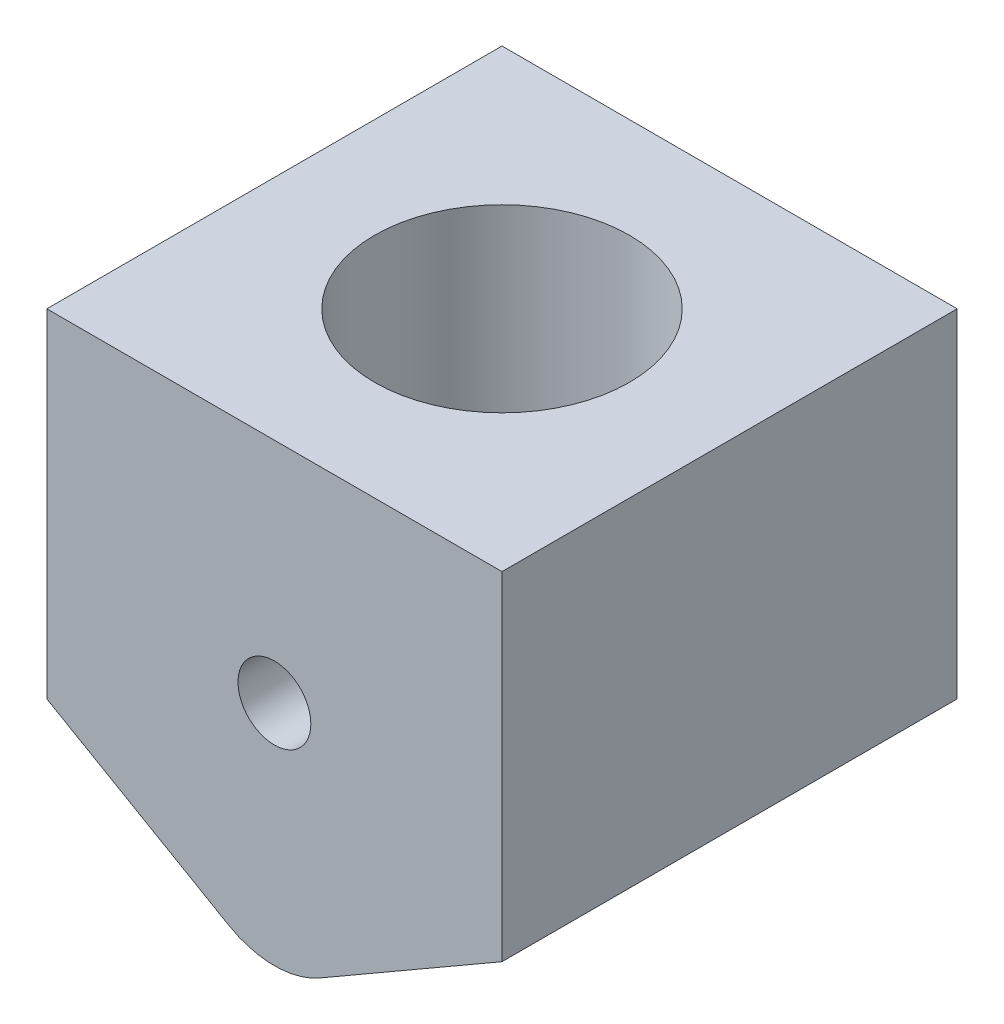
ISO-10303-21;
HEADER;
FILE_DESCRIPTION(('STEP AP214'),'2;1');
FILE_NAME('part.step','',(''),(''),'','','');
FILE_SCHEMA(('AUTOMOTIVE_DESIGN { 1 0 10303 214 1 1 1 1 }'));
ENDSEC;
DATA;
#1=APPLICATION_CONTEXT('core data for automotive mechanical design processes');
#2=APPLICATION_PROTOCOL_DEFINITION('international standard','automotive_design',2000,#1);
#3=PRODUCT_CONTEXT('',#1,'mechanical');
#4=PRODUCT('Part','Part','',(#3));
#5=PRODUCT_RELATED_PRODUCT_CATEGORY('part','',(#4));
#6=PRODUCT_DEFINITION_FORMATION('','',#4);
#7=PRODUCT_DEFINITION_CONTEXT('part definition',#1,'design');
#8=PRODUCT_DEFINITION('design','',#6,#7);
#9=PRODUCT_DEFINITION_SHAPE('','',#8);
#10=(LENGTH_UNIT() NAMED_UNIT(*) SI_UNIT(.MILLI.,.METRE.));
#11=(NAMED_UNIT(*) PLANE_ANGLE_UNIT() SI_UNIT($,.RADIAN.));
#12=(NAMED_UNIT(*) SI_UNIT($,.STERADIAN.) SOLID_ANGLE_UNIT());
#13=UNCERTAINTY_MEASURE_WITH_UNIT(LENGTH_MEASURE(1.E-05),#10,'distance_accuracy_value','');
#14=(GEOMETRIC_REPRESENTATION_CONTEXT(3) GLOBAL_UNCERTAINTY_ASSIGNED_CONTEXT((#13)) GLOBAL_UNIT_ASSIGNED_CONTEXT((#10,
#11,#12)) REPRESENTATION_CONTEXT('',''));
#15=CARTESIAN_POINT('',(0.,0.,0.));
#16=DIRECTION('',(0.,0.,1.));
#17=DIRECTION('',(1.,0.,0.));
#18=AXIS2_PLACEMENT_3D('',#15,#16,#17);
#19=CARTESIAN_POINT('',(25.,0.,25.));
#20=DIRECTION('',(-1.,0.,0.));
#21=DIRECTION('',(0.,0.,1.));
#22=AXIS2_PLACEMENT_3D('',#19,#20,#21);
#23=PLANE('',#22);
#24=DIRECTION('',(0.,1.,0.));
#25=VECTOR('',#24,1.);
#26=CARTESIAN_POINT('',(25.,0.,-25.));
#27=LINE('',#26,#25);
#28=CARTESIAN_POINT('',(25.,-37.1132486540518,-25.));
#29=VERTEX_POINT('',#28);
#30=CARTESIAN_POINT('',(25.,0.,-25.));
#31=VERTEX_POINT('',#30);
#32=EDGE_CURVE('E126',#29,#31,#27,.T.);
#33=ORIENTED_EDGE('',*,*,#32,.T.);
#34=DIRECTION('',(0.,0.,-1.));
#35=VECTOR('',#34,1.);
#36=CARTESIAN_POINT('',(25.,0.,25.));
#37=LINE('',#36,#35);
#38=CARTESIAN_POINT('',(25.,0.,25.));
#39=VERTEX_POINT('',#38);
#40=EDGE_CURVE('E11',#39,#31,#37,.T.);
#41=ORIENTED_EDGE('',*,*,#40,.F.);
#42=DIRECTION('',(0.,1.,0.));
#43=VECTOR('',#42,1.);
#44=CARTESIAN_POINT('',(25.,0.,25.));
#45=LINE('',#44,#43);
#46=CARTESIAN_POINT('',(25.,-37.1132486540518,25.));
#47=VERTEX_POINT('',#46);
#48=EDGE_CURVE('E138',#47,#39,#45,.T.);
#49=ORIENTED_EDGE('',*,*,#48,.F.);
#50=DIRECTION('',(0.,0.,-1.));
#51=VECTOR('',#50,1.);
#52=CARTESIAN_POINT('',(25.,-37.1132486540518,25.));
#53=LINE('',#52,#51);
#54=EDGE_CURVE('E122',#47,#29,#53,.T.);
#55=ORIENTED_EDGE('',*,*,#54,.T.);
#56=EDGE_LOOP('',(#33,#41,#49,#55));
#57=FACE_BOUND('',#56,.T.);
#58=ADVANCED_FACE('F37',(#57),#23,.F.);
#59=CARTESIAN_POINT('',(-25.,0.,25.));
#60=DIRECTION('',(0.,-1.,0.));
#61=DIRECTION('',(0.,0.,-1.));
#62=AXIS2_PLACEMENT_3D('',#59,#60,#61);
#63=PLANE('',#62);
#64=CARTESIAN_POINT('',(0.,0.,0.));
#65=DIRECTION('',(0.,1.,0.));
#66=DIRECTION('',(0.,0.,1.));
#67=AXIS2_PLACEMENT_3D('',#64,#65,#66);
#68=CIRCLE('',#67,14.);
#69=CARTESIAN_POINT('',(0.,0.,14.));
#70=VERTEX_POINT('',#69);
#71=EDGE_CURVE('E155',#70,#70,#68,.T.);
#72=ORIENTED_EDGE('',*,*,#71,.F.);
#73=EDGE_LOOP('',(#72));
#74=FACE_BOUND('',#73,.T.);
#75=DIRECTION('',(-1.,0.,0.));
#76=VECTOR('',#75,1.);
#77=CARTESIAN_POINT('',(-25.,0.,-25.));
#78=LINE('',#77,#76);
#79=CARTESIAN_POINT('',(-25.,0.,-25.));
#80=VERTEX_POINT('',#79);
#81=EDGE_CURVE('E129',#31,#80,#78,.T.);
#82=ORIENTED_EDGE('',*,*,#81,.T.);
#83=DIRECTION('',(0.,0.,-1.));
#84=VECTOR('',#83,1.);
#85=CARTESIAN_POINT('',(-25.,0.,25.));
#86=LINE('',#85,#84);
#87=CARTESIAN_POINT('',(-25.,0.,25.));
#88=VERTEX_POINT('',#87);
#89=EDGE_CURVE('E44',#88,#80,#86,.T.);
#90=ORIENTED_EDGE('',*,*,#89,.F.);
#91=DIRECTION('',(-1.,0.,0.));
#92=VECTOR('',#91,1.);
#93=CARTESIAN_POINT('',(-25.,0.,25.));
#94=LINE('',#93,#92);
#95=EDGE_CURVE('E91',#39,#88,#94,.T.);
#96=ORIENTED_EDGE('',*,*,#95,.F.);
#97=ORIENTED_EDGE('',*,*,#40,.T.);
#98=EDGE_LOOP('',(#82,#90,#96,#97));
#99=FACE_BOUND('',#98,.T.);
#100=ADVANCED_FACE('F193',(#74,#99),#63,.F.);
#101=CARTESIAN_POINT('',(-25.,0.,25.));
#102=DIRECTION('',(1.,0.,0.));
#103=DIRECTION('',(0.,0.,-1.));
#104=AXIS2_PLACEMENT_3D('',#101,#102,#103);
#105=PLANE('',#104);
#106=DIRECTION('',(0.,-1.,0.));
#107=VECTOR('',#106,1.);
#108=CARTESIAN_POINT('',(-25.,0.,-25.));
#109=LINE('',#108,#107);
#110=CARTESIAN_POINT('',(-25.,-37.1132486540519,-25.));
#111=VERTEX_POINT('',#110);
#112=EDGE_CURVE('E132',#80,#111,#109,.T.);
#113=ORIENTED_EDGE('',*,*,#112,.T.);
#114=DIRECTION('',(0.,0.,-1.));
#115=VECTOR('',#114,1.);
#116=CARTESIAN_POINT('',(-25.,-37.1132486540519,25.));
#117=LINE('',#116,#115);
#118=CARTESIAN_POINT('',(-25.,-37.1132486540519,25.));
#119=VERTEX_POINT('',#118);
#120=EDGE_CURVE('E117',#119,#111,#117,.T.);
#121=ORIENTED_EDGE('',*,*,#120,.F.);
#122=DIRECTION('',(0.,-1.,0.));
#123=VECTOR('',#122,1.);
#124=CARTESIAN_POINT('',(-25.,0.,25.));
#125=LINE('',#124,#123);
#126=EDGE_CURVE('E105',#88,#119,#125,.T.);
#127=ORIENTED_EDGE('',*,*,#126,.F.);
#128=ORIENTED_EDGE('',*,*,#89,.T.);
#129=EDGE_LOOP('',(#113,#121,#127,#128));
#130=FACE_BOUND('',#129,.T.);
#131=ADVANCED_FACE('F144',(#130),#105,.F.);
#132=CARTESIAN_POINT('',(-25.,-37.1132486540519,25.));
#133=DIRECTION('',(0.499999999999999,0.866025403784439,0.));
#134=DIRECTION('',(-0.866025403784439,0.499999999999999,0.));
#135=AXIS2_PLACEMENT_3D('',#132,#133,#134);
#136=PLANE('',#135);
#137=DIRECTION('',(0.866025403784439,-0.499999999999999,0.));
#138=VECTOR('',#137,1.);
#139=CARTESIAN_POINT('',(-25.,-37.1132486540519,-25.));
#140=LINE('',#139,#138);
#141=CARTESIAN_POINT('',(-4.99999999999999,-48.6602540378444,-25.));
#142=VERTEX_POINT('',#141);
#143=EDGE_CURVE('E114',#111,#142,#140,.T.);
#144=ORIENTED_EDGE('',*,*,#143,.T.);
#145=DIRECTION('',(0.,0.,-1.));
#146=VECTOR('',#145,1.);
#147=CARTESIAN_POINT('',(-4.99999999999999,-48.6602540378444,25.));
#148=LINE('',#147,#146);
#149=CARTESIAN_POINT('',(-4.99999999999999,-48.6602540378444,25.));
#150=VERTEX_POINT('',#149);
#151=EDGE_CURVE('E111',#150,#142,#148,.T.);
#152=ORIENTED_EDGE('',*,*,#151,.F.);
#153=DIRECTION('',(0.866025403784439,-0.499999999999999,0.));
#154=VECTOR('',#153,1.);
#155=CARTESIAN_POINT('',(-25.,-37.1132486540519,25.));
#156=LINE('',#155,#154);
#157=EDGE_CURVE('E98',#119,#150,#156,.T.);
#158=ORIENTED_EDGE('',*,*,#157,.F.);
#159=ORIENTED_EDGE('',*,*,#120,.T.);
#160=EDGE_LOOP('',(#144,#152,#158,#159));
#161=FACE_BOUND('',#160,.T.);
#162=ADVANCED_FACE('F112',(#161),#136,.F.);
#163=CARTESIAN_POINT('',(1.87783816274489E-13,-40.,25.));
#164=DIRECTION('',(0.,0.,-1.));
#165=DIRECTION('',(-1.,0.,0.));
#166=AXIS2_PLACEMENT_3D('',#163,#164,#165);
#167=CYLINDRICAL_SURFACE('',#166,10.);
#168=CARTESIAN_POINT('',(1.87783816274489E-13,-40.,-25.));
#169=DIRECTION('',(0.,0.,1.));
#170=DIRECTION('',(-1.,0.,0.));
#171=AXIS2_PLACEMENT_3D('',#168,#169,#170);
#172=CIRCLE('',#171,10.);
#173=CARTESIAN_POINT('',(5.00000000000005,-48.6602540378445,-25.));
#174=VERTEX_POINT('',#173);
#175=EDGE_CURVE('E135',#142,#174,#172,.T.);
#176=ORIENTED_EDGE('',*,*,#175,.T.);
#177=DIRECTION('',(0.,0.,-1.));
#178=VECTOR('',#177,1.);
#179=CARTESIAN_POINT('',(5.00000000000005,-48.6602540378445,25.));
#180=LINE('',#179,#178);
#181=CARTESIAN_POINT('',(5.00000000000005,-48.6602540378445,25.));
#182=VERTEX_POINT('',#181);
#183=EDGE_CURVE('E118',#182,#174,#180,.T.);
#184=ORIENTED_EDGE('',*,*,#183,.F.);
#185=CARTESIAN_POINT('',(1.87783816274489E-13,-40.,25.));
#186=DIRECTION('',(0.,0.,1.));
#187=DIRECTION('',(-1.,0.,0.));
#188=AXIS2_PLACEMENT_3D('',#185,#186,#187);
#189=CIRCLE('',#188,10.);
#190=EDGE_CURVE('E102',#150,#182,#189,.T.);
#191=ORIENTED_EDGE('',*,*,#190,.F.);
#192=ORIENTED_EDGE('',*,*,#151,.T.);
#193=EDGE_LOOP('',(#176,#184,#191,#192));
#194=FACE_BOUND('',#193,.T.);
#195=ADVANCED_FACE('F120',(#194),#167,.T.);
#196=CARTESIAN_POINT('',(25.,-37.1132486540518,25.));
#197=DIRECTION('',(-0.500000000000001,0.866025403784438,0.));
#198=DIRECTION('',(-0.866025403784438,-0.500000000000001,0.));
#199=AXIS2_PLACEMENT_3D('',#196,#197,#198);
#200=PLANE('',#199);
#201=DIRECTION('',(0.866025403784438,0.500000000000001,0.));
#202=VECTOR('',#201,1.);
#203=CARTESIAN_POINT('',(25.,-37.1132486540518,-25.));
#204=LINE('',#203,#202);
#205=EDGE_CURVE('E83',#174,#29,#204,.T.);
#206=ORIENTED_EDGE('',*,*,#205,.T.);
#207=ORIENTED_EDGE('',*,*,#54,.F.);
#208=DIRECTION('',(0.866025403784438,0.500000000000001,0.));
#209=VECTOR('',#208,1.);
#210=CARTESIAN_POINT('',(25.,-37.1132486540518,25.));
#211=LINE('',#210,#209);
#212=EDGE_CURVE('E57',#182,#47,#211,.T.);
#213=ORIENTED_EDGE('',*,*,#212,.F.);
#214=ORIENTED_EDGE('',*,*,#183,.T.);
#215=EDGE_LOOP('',(#206,#207,#213,#214));
#216=FACE_BOUND('',#215,.T.);
#217=ADVANCED_FACE('F148',(#216),#200,.F.);
#218=CARTESIAN_POINT('',(1.87783816274489E-13,-40.,25.));
#219=DIRECTION('',(0.,0.,-1.));
#220=DIRECTION('',(-1.,0.,0.));
#221=AXIS2_PLACEMENT_3D('',#218,#219,#220);
#222=PLANE('',#221);
#223=CARTESIAN_POINT('',(0.,-25.,25.));
#224=DIRECTION('',(0.,0.,1.));
#225=DIRECTION('',(1.,0.,0.));
#226=AXIS2_PLACEMENT_3D('',#223,#224,#225);
#227=CIRCLE('',#226,4.);
#228=CARTESIAN_POINT('',(4.,-25.,25.));
#229=VERTEX_POINT('',#228);
#230=EDGE_CURVE('E166',#229,#229,#227,.T.);
#231=ORIENTED_EDGE('',*,*,#230,.F.);
#232=EDGE_LOOP('',(#231));
#233=FACE_BOUND('',#232,.T.);
#234=ORIENTED_EDGE('',*,*,#48,.T.);
#235=ORIENTED_EDGE('',*,*,#95,.T.);
#236=ORIENTED_EDGE('',*,*,#126,.T.);
#237=ORIENTED_EDGE('',*,*,#157,.T.);
#238=ORIENTED_EDGE('',*,*,#190,.T.);
#239=ORIENTED_EDGE('',*,*,#212,.T.);
#240=EDGE_LOOP('',(#234,#235,#236,#237,#238,#239));
#241=FACE_BOUND('',#240,.T.);
#242=ADVANCED_FACE('F100',(#233,#241),#222,.F.);
#243=CARTESIAN_POINT('',(1.87783816274489E-13,-40.,-25.));
#244=DIRECTION('',(0.,0.,-1.));
#245=DIRECTION('',(-1.,0.,0.));
#246=AXIS2_PLACEMENT_3D('',#243,#244,#245);
#247=PLANE('',#246);
#248=ORIENTED_EDGE('',*,*,#32,.F.);
#249=ORIENTED_EDGE('',*,*,#205,.F.);
#250=ORIENTED_EDGE('',*,*,#175,.F.);
#251=ORIENTED_EDGE('',*,*,#143,.F.);
#252=ORIENTED_EDGE('',*,*,#112,.F.);
#253=ORIENTED_EDGE('',*,*,#81,.F.);
#254=EDGE_LOOP('',(#248,#249,#250,#251,#252,#253));
#255=FACE_BOUND('',#254,.T.);
#256=ADVANCED_FACE('F147',(#255),#247,.T.);
#257=CARTESIAN_POINT('',(0.,-29.,0.));
#258=DIRECTION('',(0.,1.,0.));
#259=DIRECTION('',(0.,0.,1.));
#260=AXIS2_PLACEMENT_3D('',#257,#258,#259);
#261=CYLINDRICAL_SURFACE('',#260,14.);
#262=CARTESIAN_POINT('',(0.,-29.,0.));
#263=DIRECTION('',(0.,1.,0.));
#264=DIRECTION('',(0.,0.,1.));
#265=AXIS2_PLACEMENT_3D('',#262,#263,#264);
#266=CIRCLE('',#265,14.);
#267=CARTESIAN_POINT('',(0.,-29.,14.));
#268=VERTEX_POINT('',#267);
#269=EDGE_CURVE('E130',#268,#268,#266,.T.);
#270=ORIENTED_EDGE('',*,*,#269,.F.);
#271=CARTESIAN_POINT('',(0.,-29.,14.));
#272=CARTESIAN_POINT('',(-0.219909804754502,-28.9999961208761,13.9999973858868));
#273=CARTESIAN_POINT('',(-0.439859495745163,-28.9818044220478,13.9947683480409));
#274=CARTESIAN_POINT('',(-0.873383982393978,-28.9096714597954,13.9744181189021));
#275=CARTESIAN_POINT('',(-1.08695633365923,-28.8557166678518,13.9592931842017));
#276=CARTESIAN_POINT('',(-1.50140860147574,-28.713983923167,13.9208138269815));
#277=CARTESIAN_POINT('',(-1.70230576169645,-28.6262531276961,13.8974708821268));
#278=CARTESIAN_POINT('',(-2.08653752225854,-28.4196440170433,13.8449995663309));
#279=CARTESIAN_POINT('',(-2.26987028235633,-28.3007624430193,13.8158705901604));
#280=CARTESIAN_POINT('',(-2.61858889371789,-28.0319299786542,13.7540946925116));
#281=CARTESIAN_POINT('',(-2.78344744476188,-27.8813104922895,13.7213808389038));
#282=CARTESIAN_POINT('',(-3.0859427158487,-27.5547045137246,13.6565346983128));
#283=CARTESIAN_POINT('',(-3.22357535415565,-27.3787142247355,13.6244024991869));
#284=CARTESIAN_POINT('',(-3.4703958001286,-27.0020128344182,13.5636602975078));
#285=CARTESIAN_POINT('',(-3.57895642206696,-26.8008760298703,13.5351340501204));
#286=CARTESIAN_POINT('',(-3.76050341107961,-26.3822559764985,13.4858268768133));
#287=CARTESIAN_POINT('',(-3.83349743111438,-26.1647762558582,13.4650442848974));
#288=CARTESIAN_POINT('',(-3.9399686602775,-25.7255304736689,13.4342721639203));
#289=CARTESIAN_POINT('',(-3.97441106405699,-25.5040172744643,13.4240195714002));
#290=CARTESIAN_POINT('',(-4.00581335578369,-25.0581377031078,13.4146841640399));
#291=CARTESIAN_POINT('',(-4.00278138819242,-24.8337719614996,13.4155989221522));
#292=CARTESIAN_POINT('',(-3.96008269525806,-24.3962627770877,13.4282606881987));
#293=CARTESIAN_POINT('',(-3.92160651456782,-24.1829912976385,13.4396556539587));
#294=CARTESIAN_POINT('',(-3.81102772171578,-23.7660655607448,13.4714269676562));
#295=CARTESIAN_POINT('',(-3.73892206962499,-23.562412174559,13.4918041275281));
#296=CARTESIAN_POINT('',(-3.56221362275624,-23.1675075111364,13.5395372703216));
#297=CARTESIAN_POINT('',(-3.45721102345763,-22.9764458551967,13.566978328113));
#298=CARTESIAN_POINT('',(-3.21796758335769,-22.6142468775732,13.6257043376412));
#299=CARTESIAN_POINT('',(-3.08372023346689,-22.4431140045302,13.6569901444382));
#300=CARTESIAN_POINT('',(-2.78380799346042,-22.1188552487873,13.7213250131271));
#301=CARTESIAN_POINT('',(-2.61714974969065,-21.9666510480655,13.7543960914473));
#302=CARTESIAN_POINT('',(-2.26026456477245,-21.6921479927194,13.8175249443669));
#303=CARTESIAN_POINT('',(-2.07003640296378,-21.5698506879166,13.8475825627565));
#304=CARTESIAN_POINT('',(-1.66984614618289,-21.3581425304519,13.90153056131));
#305=CARTESIAN_POINT('',(-1.45977963562001,-21.2689194263916,13.9253855099446));
#306=CARTESIAN_POINT('',(-1.02678645993494,-21.1273322171664,13.9639850297517));
#307=CARTESIAN_POINT('',(-0.803863051620289,-21.0749588215095,13.9787318971251));
#308=CARTESIAN_POINT('',(-0.359332777288698,-21.0100534285811,13.9970974902934));
#309=CARTESIAN_POINT('',(-0.137922693721014,-20.9962706092539,14.001065457012));
#310=CARTESIAN_POINT('',(0.304053053611167,-21.0054545326021,13.9984416941418));
#311=CARTESIAN_POINT('',(0.524618815514217,-21.0284168656918,13.9918512316126));
#312=CARTESIAN_POINT('',(0.95403726686063,-21.1094208886325,13.9690785337041));
#313=CARTESIAN_POINT('',(1.16303642346969,-21.1667463626468,13.9530922603535));
#314=CARTESIAN_POINT('',(1.56841737241128,-21.3140010039693,13.9133599748377));
#315=CARTESIAN_POINT('',(1.76479770249744,-21.4039339417787,13.8896130653177));
#316=CARTESIAN_POINT('',(2.14408337024006,-21.6160466732903,13.8361992233827));
#317=CARTESIAN_POINT('',(2.32660497308018,-21.7388823976507,13.806415263566));
#318=CARTESIAN_POINT('',(2.66887705611895,-22.0125050119022,13.7443589419696));
#319=CARTESIAN_POINT('',(2.82862234168611,-22.1632982601291,13.7120860151051));
#320=CARTESIAN_POINT('',(3.12621285668013,-22.4944186840989,13.6473723925859));
#321=CARTESIAN_POINT('',(3.2631708548142,-22.6755505511183,13.6149607371547));
#322=CARTESIAN_POINT('',(3.5047906321352,-23.0589251772491,13.5547778947072));
#323=CARTESIAN_POINT('',(3.60945353497364,-23.2611672015417,13.5270065462548));
#324=CARTESIAN_POINT('',(3.78274908236532,-23.6801824219512,13.4795730248143));
#325=CARTESIAN_POINT('',(3.85157266479217,-23.8968715269982,13.4598680004307));
#326=CARTESIAN_POINT('',(3.9515890013583,-24.3394198711467,13.4308491335485));
#327=CARTESIAN_POINT('',(3.98279315803512,-24.5652763101419,13.4215321424767));
#328=CARTESIAN_POINT('',(4.00596048493462,-25.0105920659006,13.414634061985));
#329=CARTESIAN_POINT('',(3.99936055287513,-25.229971009185,13.4166232140829));
#330=CARTESIAN_POINT('',(3.95049421913723,-25.6643494613865,13.43109194205));
#331=CARTESIAN_POINT('',(3.9082290075969,-25.8793491161938,13.4435711678689));
#332=CARTESIAN_POINT('',(3.79011937633831,-26.2967567423123,13.4773395437571));
#333=CARTESIAN_POINT('',(3.71462183572859,-26.4992707740157,13.4985375411261));
#334=CARTESIAN_POINT('',(3.53245898603034,-26.8889174689911,13.5473460566956));
#335=CARTESIAN_POINT('',(3.42578816086269,-27.0760474025483,13.5749577096079));
#336=CARTESIAN_POINT('',(3.18013093069693,-27.4363670436088,13.6346333790399));
#337=CARTESIAN_POINT('',(3.04018455445474,-27.6088827826834,13.6668152635923));
#338=CARTESIAN_POINT('',(2.73371968075859,-27.9284477916201,13.7313969018336));
#339=CARTESIAN_POINT('',(2.56719450145708,-28.0754906382217,13.7637967083404));
#340=CARTESIAN_POINT('',(2.20714864173081,-28.3436743686531,13.8261591914504));
#341=CARTESIAN_POINT('',(2.01304500471956,-28.4640539745392,13.8560380207491));
#342=CARTESIAN_POINT('',(1.60650105929331,-28.6702915700441,13.9090279155586));
#343=CARTESIAN_POINT('',(1.39407084822947,-28.7561684238661,13.9321426774055));
#344=CARTESIAN_POINT('',(0.985832630670068,-28.8816951027909,13.9665468945063));
#345=CARTESIAN_POINT('',(0.791526015248779,-28.9259470733691,13.9789936872416));
#346=CARTESIAN_POINT('',(0.398156737572732,-28.9850993144843,13.9957208770429));
#347=CARTESIAN_POINT('',(0.199094715232183,-29.0000035119538,14.0000023666799));
#348=CARTESIAN_POINT('',(0.,-29.,14.));
#349=B_SPLINE_CURVE_WITH_KNOTS('',3,(#271,#272,#273,#274,#275,#276,#277,#278,#279,#280,#281,
#282,#283,#284,#285,#286,#287,#288,#289,#290,#291,#292,#293,#294,#295,#296,#297,#298,#299,#300,
#301,#302,#303,#304,#305,#306,#307,#308,#309,#310,#311,#312,#313,#314,#315,#316,#317,#318,#319,
#320,#321,#322,#323,#324,#325,#326,#327,#328,#329,#330,#331,#332,#333,#334,#335,#336,#337,#338,
#339,#340,#341,#342,#343,#344,#345,#346,#347,#348),.UNSPECIFIED.,.T.,.F.,(4,2,2,2,2,2,2,2,2,2,2,
2,2,2,2,2,2,2,2,2,2,2,2,2,2,2,2,2,2,2,2,2,2,2,2,2,2,2,4),(0.,0.658998625084688,1.31824667959036,
1.97657762579069,2.63497747087032,3.30895623061562,3.98303595747427,4.67066150600114,
5.35813903089619,6.02799019725499,6.69769578462466,7.34569571658666,7.99375423572252,
8.6500160658242,9.30642411154686,9.98757001205003,10.668751203109,11.353742022089,
12.0385600802922,12.700909153964,13.363178748693,14.0121028095904,14.6611019315106,
15.324150506889,15.9873500637558,16.6722420976867,17.357110299306,18.0382914673228,
18.7192661157547,19.374533632379,20.0297792838166,20.6783419259223,21.3270194000485,
21.9973531379043,22.6678556622664,23.3555595795003,24.0428869847787,24.6395893608559,
25.2362118886514),.UNSPECIFIED.);
#350=EDGE_CURVE('E49',#268,#268,#349,.T.);
#351=ORIENTED_EDGE('',*,*,#350,.F.);
#352=EDGE_LOOP('',(#270,#351));
#353=FACE_BOUND('',#352,.T.);
#354=ORIENTED_EDGE('',*,*,#71,.T.);
#355=EDGE_LOOP('',(#354));
#356=FACE_BOUND('',#355,.T.);
#357=ADVANCED_FACE('F176',(#353,#356),#261,.F.);
#358=CARTESIAN_POINT('',(0.,-29.,0.));
#359=DIRECTION('',(0.,1.,0.));
#360=DIRECTION('',(0.,0.,1.));
#361=AXIS2_PLACEMENT_3D('',#358,#359,#360);
#362=PLANE('',#361);
#363=ORIENTED_EDGE('',*,*,#269,.T.);
#364=EDGE_LOOP('',(#363));
#365=FACE_BOUND('',#364,.T.);
#366=ADVANCED_FACE('F172',(#365),#362,.T.);
#367=CARTESIAN_POINT('',(0.,-25.,-25.001));
#368=DIRECTION('',(0.,0.,1.));
#369=DIRECTION('',(1.,0.,0.));
#370=AXIS2_PLACEMENT_3D('',#367,#368,#369);
#371=CYLINDRICAL_SURFACE('',#370,4.);
#372=ORIENTED_EDGE('',*,*,#230,.T.);
#373=EDGE_LOOP('',(#372));
#374=FACE_BOUND('',#373,.T.);
#375=ORIENTED_EDGE('',*,*,#350,.T.);
#376=EDGE_LOOP('',(#375));
#377=FACE_BOUND('',#376,.T.);
#378=ADVANCED_FACE('F167',(#374,#377),#371,.F.);
#379=CLOSED_SHELL('',(#58,#100,#131,#162,#195,#217,#242,#256,#357,#366,#378));
#380=MANIFOLD_SOLID_BREP('B2',#379);
#381=ADVANCED_BREP_SHAPE_REPRESENTATION('',(#18,#380),#14);
#382=SHAPE_DEFINITION_REPRESENTATION(#9,#381);
ENDSEC;
END-ISO-10303-21;
